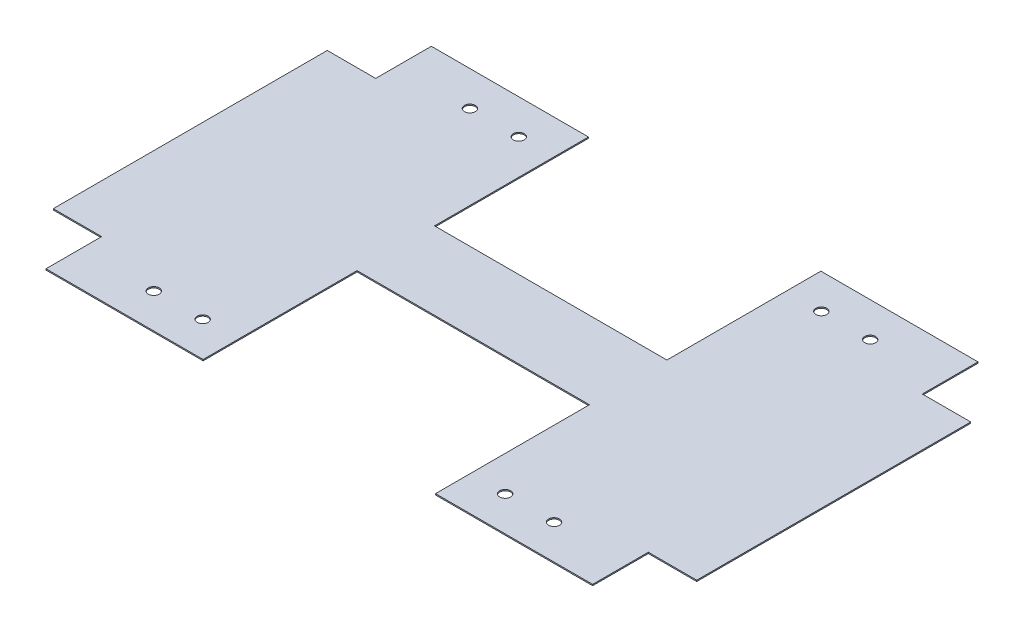
ISO-10303-21;
HEADER;
FILE_DESCRIPTION(('STEP AP214'),'2;1');
FILE_NAME('part.step','',(''),(''),'','','');
FILE_SCHEMA(('AUTOMOTIVE_DESIGN { 1 0 10303 214 1 1 1 1 }'));
ENDSEC;
DATA;
#1=APPLICATION_CONTEXT('core data for automotive mechanical design processes');
#2=APPLICATION_PROTOCOL_DEFINITION('international standard','automotive_design',2000,#1);
#3=PRODUCT_CONTEXT('',#1,'mechanical');
#4=PRODUCT('Part','Part','',(#3));
#5=PRODUCT_RELATED_PRODUCT_CATEGORY('part','',(#4));
#6=PRODUCT_DEFINITION_FORMATION('','',#4);
#7=PRODUCT_DEFINITION_CONTEXT('part definition',#1,'design');
#8=PRODUCT_DEFINITION('design','',#6,#7);
#9=PRODUCT_DEFINITION_SHAPE('','',#8);
#10=(LENGTH_UNIT() NAMED_UNIT(*) SI_UNIT(.MILLI.,.METRE.));
#11=(NAMED_UNIT(*) PLANE_ANGLE_UNIT() SI_UNIT($,.RADIAN.));
#12=(NAMED_UNIT(*) SI_UNIT($,.STERADIAN.) SOLID_ANGLE_UNIT());
#13=UNCERTAINTY_MEASURE_WITH_UNIT(LENGTH_MEASURE(1.E-05),#10,'distance_accuracy_value','');
#14=(GEOMETRIC_REPRESENTATION_CONTEXT(3) GLOBAL_UNCERTAINTY_ASSIGNED_CONTEXT((#13)) GLOBAL_UNIT_ASSIGNED_CONTEXT((#10,
#11,#12)) REPRESENTATION_CONTEXT('',''));
#15=CARTESIAN_POINT('',(0.,0.,0.));
#16=DIRECTION('',(0.,0.,1.));
#17=DIRECTION('',(1.,0.,0.));
#18=AXIS2_PLACEMENT_3D('',#15,#16,#17);
#19=CARTESIAN_POINT('',(-24.,0.25,-39.8));
#20=DIRECTION('',(0.,-1.,0.));
#21=DIRECTION('',(0.,0.,-1.));
#22=AXIS2_PLACEMENT_3D('',#19,#20,#21);
#23=PLANE('',#22);
#24=CARTESIAN_POINT('',(-31.24,0.25,32.65));
#25=DIRECTION('',(0.,1.,0.));
#26=DIRECTION('',(0.,0.,1.));
#27=AXIS2_PLACEMENT_3D('',#24,#25,#26);
#28=CIRCLE('',#27,1.125);
#29=CARTESIAN_POINT('',(-31.24,0.25,33.775));
#30=VERTEX_POINT('',#29);
#31=EDGE_CURVE('E412',#30,#30,#28,.T.);
#32=ORIENTED_EDGE('',*,*,#31,.F.);
#33=EDGE_LOOP('',(#32));
#34=FACE_BOUND('',#33,.T.);
#35=CARTESIAN_POINT('',(41.34,0.25,32.65));
#36=DIRECTION('',(0.,1.,0.));
#37=DIRECTION('',(0.,0.,1.));
#38=AXIS2_PLACEMENT_3D('',#35,#36,#37);
#39=CIRCLE('',#38,1.125);
#40=CARTESIAN_POINT('',(41.34,0.25,33.775));
#41=VERTEX_POINT('',#40);
#42=EDGE_CURVE('E424',#41,#41,#39,.T.);
#43=ORIENTED_EDGE('',*,*,#42,.F.);
#44=EDGE_LOOP('',(#43));
#45=FACE_BOUND('',#44,.T.);
#46=CARTESIAN_POINT('',(31.24,0.25,-32.65));
#47=DIRECTION('',(0.,1.,0.));
#48=DIRECTION('',(0.,0.,1.));
#49=AXIS2_PLACEMENT_3D('',#46,#47,#48);
#50=CIRCLE('',#49,1.12499999999999);
#51=CARTESIAN_POINT('',(31.24,0.25,-31.525));
#52=VERTEX_POINT('',#51);
#53=EDGE_CURVE('E436',#52,#52,#50,.T.);
#54=ORIENTED_EDGE('',*,*,#53,.F.);
#55=EDGE_LOOP('',(#54));
#56=FACE_BOUND('',#55,.T.);
#57=CARTESIAN_POINT('',(-41.34,0.25,-32.65));
#58=DIRECTION('',(0.,1.,0.));
#59=DIRECTION('',(0.,0.,1.));
#60=AXIS2_PLACEMENT_3D('',#57,#58,#59);
#61=CIRCLE('',#60,1.125);
#62=CARTESIAN_POINT('',(-41.34,0.25,-31.525));
#63=VERTEX_POINT('',#62);
#64=EDGE_CURVE('E206',#63,#63,#61,.T.);
#65=ORIENTED_EDGE('',*,*,#64,.F.);
#66=EDGE_LOOP('',(#65));
#67=FACE_BOUND('',#66,.T.);
#68=DIRECTION('',(-1.,0.,0.));
#69=VECTOR('',#68,1.);
#70=CARTESIAN_POINT('',(-56.46,0.25,-39.8));
#71=LINE('',#70,#69);
#72=CARTESIAN_POINT('',(-24.,0.25,-39.8));
#73=VERTEX_POINT('',#72);
#74=CARTESIAN_POINT('',(-56.46,0.25,-39.8));
#75=VERTEX_POINT('',#74);
#76=EDGE_CURVE('E241',#73,#75,#71,.T.);
#77=ORIENTED_EDGE('',*,*,#76,.T.);
#78=DIRECTION('',(0.,0.,1.));
#79=VECTOR('',#78,1.);
#80=CARTESIAN_POINT('',(-56.46,0.25,-39.8));
#81=LINE('',#80,#79);
#82=CARTESIAN_POINT('',(-56.46,0.25,-28.3));
#83=VERTEX_POINT('',#82);
#84=EDGE_CURVE('E129',#75,#83,#81,.T.);
#85=ORIENTED_EDGE('',*,*,#84,.T.);
#86=DIRECTION('',(-1.,0.,0.));
#87=VECTOR('',#86,1.);
#88=CARTESIAN_POINT('',(-56.46,0.25,-28.3));
#89=LINE('',#88,#87);
#90=CARTESIAN_POINT('',(-66.46,0.25,-28.3));
#91=VERTEX_POINT('',#90);
#92=EDGE_CURVE('E292',#83,#91,#89,.T.);
#93=ORIENTED_EDGE('',*,*,#92,.T.);
#94=DIRECTION('',(0.,0.,1.));
#95=VECTOR('',#94,1.);
#96=CARTESIAN_POINT('',(-66.46,0.25,-28.3));
#97=LINE('',#96,#95);
#98=CARTESIAN_POINT('',(-66.46,0.25,28.3));
#99=VERTEX_POINT('',#98);
#100=EDGE_CURVE('E311',#91,#99,#97,.T.);
#101=ORIENTED_EDGE('',*,*,#100,.T.);
#102=DIRECTION('',(1.,0.,0.));
#103=VECTOR('',#102,1.);
#104=CARTESIAN_POINT('',(-66.46,0.25,28.3));
#105=LINE('',#104,#103);
#106=CARTESIAN_POINT('',(-56.46,0.25,28.3));
#107=VERTEX_POINT('',#106);
#108=EDGE_CURVE('E308',#99,#107,#105,.T.);
#109=ORIENTED_EDGE('',*,*,#108,.T.);
#110=DIRECTION('',(0.,0.,1.));
#111=VECTOR('',#110,1.);
#112=CARTESIAN_POINT('',(-56.46,0.25,28.3));
#113=LINE('',#112,#111);
#114=CARTESIAN_POINT('',(-56.46,0.25,39.8));
#115=VERTEX_POINT('',#114);
#116=EDGE_CURVE('E310',#107,#115,#113,.T.);
#117=ORIENTED_EDGE('',*,*,#116,.T.);
#118=DIRECTION('',(1.,0.,0.));
#119=VECTOR('',#118,1.);
#120=CARTESIAN_POINT('',(-56.46,0.25,39.8));
#121=LINE('',#120,#119);
#122=CARTESIAN_POINT('',(-24.,0.25,39.8));
#123=VERTEX_POINT('',#122);
#124=EDGE_CURVE('E313',#115,#123,#121,.T.);
#125=ORIENTED_EDGE('',*,*,#124,.T.);
#126=DIRECTION('',(0.,0.,-1.));
#127=VECTOR('',#126,1.);
#128=CARTESIAN_POINT('',(-24.,0.25,39.8));
#129=LINE('',#128,#127);
#130=CARTESIAN_POINT('',(-24.,0.25,8.00000000000001));
#131=VERTEX_POINT('',#130);
#132=EDGE_CURVE('E319',#123,#131,#129,.T.);
#133=ORIENTED_EDGE('',*,*,#132,.T.);
#134=DIRECTION('',(1.,0.,0.));
#135=VECTOR('',#134,1.);
#136=CARTESIAN_POINT('',(-24.,0.25,8.00000000000001));
#137=LINE('',#136,#135);
#138=CARTESIAN_POINT('',(24.,0.25,8.00000000000001));
#139=VERTEX_POINT('',#138);
#140=EDGE_CURVE('E321',#131,#139,#137,.T.);
#141=ORIENTED_EDGE('',*,*,#140,.T.);
#142=DIRECTION('',(0.,0.,1.));
#143=VECTOR('',#142,1.);
#144=CARTESIAN_POINT('',(24.,0.25,8.00000000000001));
#145=LINE('',#144,#143);
#146=CARTESIAN_POINT('',(24.,0.25,39.8));
#147=VERTEX_POINT('',#146);
#148=EDGE_CURVE('E323',#139,#147,#145,.T.);
#149=ORIENTED_EDGE('',*,*,#148,.T.);
#150=DIRECTION('',(1.,0.,0.));
#151=VECTOR('',#150,1.);
#152=CARTESIAN_POINT('',(24.,0.25,39.8));
#153=LINE('',#152,#151);
#154=CARTESIAN_POINT('',(56.46,0.25,39.8));
#155=VERTEX_POINT('',#154);
#156=EDGE_CURVE('E325',#147,#155,#153,.T.);
#157=ORIENTED_EDGE('',*,*,#156,.T.);
#158=DIRECTION('',(0.,0.,-1.));
#159=VECTOR('',#158,1.);
#160=CARTESIAN_POINT('',(56.46,0.25,28.3));
#161=LINE('',#160,#159);
#162=CARTESIAN_POINT('',(56.46,0.25,28.3));
#163=VERTEX_POINT('',#162);
#164=EDGE_CURVE('E327',#155,#163,#161,.T.);
#165=ORIENTED_EDGE('',*,*,#164,.T.);
#166=DIRECTION('',(1.,0.,0.));
#167=VECTOR('',#166,1.);
#168=CARTESIAN_POINT('',(66.46,0.25,28.3));
#169=LINE('',#168,#167);
#170=CARTESIAN_POINT('',(66.46,0.25,28.3));
#171=VERTEX_POINT('',#170);
#172=EDGE_CURVE('E329',#163,#171,#169,.T.);
#173=ORIENTED_EDGE('',*,*,#172,.T.);
#174=DIRECTION('',(0.,0.,-1.));
#175=VECTOR('',#174,1.);
#176=CARTESIAN_POINT('',(66.46,0.25,-28.3));
#177=LINE('',#176,#175);
#178=CARTESIAN_POINT('',(66.46,0.25,-28.3));
#179=VERTEX_POINT('',#178);
#180=EDGE_CURVE('E331',#171,#179,#177,.T.);
#181=ORIENTED_EDGE('',*,*,#180,.T.);
#182=DIRECTION('',(-1.,0.,0.));
#183=VECTOR('',#182,1.);
#184=CARTESIAN_POINT('',(66.46,0.25,-28.3));
#185=LINE('',#184,#183);
#186=CARTESIAN_POINT('',(56.46,0.25,-28.3));
#187=VERTEX_POINT('',#186);
#188=EDGE_CURVE('E333',#179,#187,#185,.T.);
#189=ORIENTED_EDGE('',*,*,#188,.T.);
#190=DIRECTION('',(0.,0.,-1.));
#191=VECTOR('',#190,1.);
#192=CARTESIAN_POINT('',(56.46,0.25,-28.3));
#193=LINE('',#192,#191);
#194=CARTESIAN_POINT('',(56.46,0.25,-39.8));
#195=VERTEX_POINT('',#194);
#196=EDGE_CURVE('E335',#187,#195,#193,.T.);
#197=ORIENTED_EDGE('',*,*,#196,.T.);
#198=DIRECTION('',(-1.,0.,0.));
#199=VECTOR('',#198,1.);
#200=CARTESIAN_POINT('',(24.,0.25,-39.8));
#201=LINE('',#200,#199);
#202=CARTESIAN_POINT('',(24.,0.25,-39.8));
#203=VERTEX_POINT('',#202);
#204=EDGE_CURVE('E184',#195,#203,#201,.T.);
#205=ORIENTED_EDGE('',*,*,#204,.T.);
#206=DIRECTION('',(0.,0.,1.));
#207=VECTOR('',#206,1.);
#208=CARTESIAN_POINT('',(24.,0.25,-8.));
#209=LINE('',#208,#207);
#210=CARTESIAN_POINT('',(24.,0.25,-8.));
#211=VERTEX_POINT('',#210);
#212=EDGE_CURVE('E178',#203,#211,#209,.T.);
#213=ORIENTED_EDGE('',*,*,#212,.T.);
#214=DIRECTION('',(-1.,0.,0.));
#215=VECTOR('',#214,1.);
#216=CARTESIAN_POINT('',(-24.,0.25,-7.99999999999999));
#217=LINE('',#216,#215);
#218=CARTESIAN_POINT('',(-24.,0.25,-7.99999999999999));
#219=VERTEX_POINT('',#218);
#220=EDGE_CURVE('E182',#211,#219,#217,.T.);
#221=ORIENTED_EDGE('',*,*,#220,.T.);
#222=DIRECTION('',(0.,0.,-1.));
#223=VECTOR('',#222,1.);
#224=CARTESIAN_POINT('',(-24.,0.25,-39.8));
#225=LINE('',#224,#223);
#226=EDGE_CURVE('E50',#219,#73,#225,.T.);
#227=ORIENTED_EDGE('',*,*,#226,.T.);
#228=EDGE_LOOP('',(#77,#85,#93,#101,#109,#117,#125,#133,#141,#149,#157,#165,#173,#181,#189,#197,
#205,#213,#221,#227));
#229=FACE_BOUND('',#228,.T.);
#230=CARTESIAN_POINT('',(-31.24,0.25,-32.65));
#231=DIRECTION('',(0.,1.,0.));
#232=DIRECTION('',(0.,0.,1.));
#233=AXIS2_PLACEMENT_3D('',#230,#231,#232);
#234=CIRCLE('',#233,1.125);
#235=CARTESIAN_POINT('',(-31.24,0.25,-31.525));
#236=VERTEX_POINT('',#235);
#237=EDGE_CURVE('E442',#236,#236,#234,.T.);
#238=ORIENTED_EDGE('',*,*,#237,.F.);
#239=EDGE_LOOP('',(#238));
#240=FACE_BOUND('',#239,.T.);
#241=CARTESIAN_POINT('',(41.34,0.25,-32.65));
#242=DIRECTION('',(0.,1.,0.));
#243=DIRECTION('',(0.,0.,1.));
#244=AXIS2_PLACEMENT_3D('',#241,#242,#243);
#245=CIRCLE('',#244,1.125);
#246=CARTESIAN_POINT('',(41.34,0.25,-31.525));
#247=VERTEX_POINT('',#246);
#248=EDGE_CURVE('E430',#247,#247,#245,.T.);
#249=ORIENTED_EDGE('',*,*,#248,.F.);
#250=EDGE_LOOP('',(#249));
#251=FACE_BOUND('',#250,.T.);
#252=CARTESIAN_POINT('',(31.24,0.25,32.65));
#253=DIRECTION('',(0.,1.,0.));
#254=DIRECTION('',(0.,0.,1.));
#255=AXIS2_PLACEMENT_3D('',#252,#253,#254);
#256=CIRCLE('',#255,1.12499999999999);
#257=CARTESIAN_POINT('',(31.24,0.25,33.775));
#258=VERTEX_POINT('',#257);
#259=EDGE_CURVE('E418',#258,#258,#256,.T.);
#260=ORIENTED_EDGE('',*,*,#259,.F.);
#261=EDGE_LOOP('',(#260));
#262=FACE_BOUND('',#261,.T.);
#263=CARTESIAN_POINT('',(-41.34,0.25,32.65));
#264=DIRECTION('',(0.,1.,0.));
#265=DIRECTION('',(0.,0.,1.));
#266=AXIS2_PLACEMENT_3D('',#263,#264,#265);
#267=CIRCLE('',#266,1.125);
#268=CARTESIAN_POINT('',(-41.34,0.25,33.775));
#269=VERTEX_POINT('',#268);
#270=EDGE_CURVE('E403',#269,#269,#267,.T.);
#271=ORIENTED_EDGE('',*,*,#270,.F.);
#272=EDGE_LOOP('',(#271));
#273=FACE_BOUND('',#272,.T.);
#274=ADVANCED_FACE('F33',(#34,#45,#56,#67,#229,#240,#251,#262,#273),#23,.F.);
#275=CARTESIAN_POINT('',(-24.,0.,-39.8));
#276=DIRECTION('',(0.,-1.,0.));
#277=DIRECTION('',(0.,0.,-1.));
#278=AXIS2_PLACEMENT_3D('',#275,#276,#277);
#279=PLANE('',#278);
#280=CARTESIAN_POINT('',(-31.24,0.,32.65));
#281=DIRECTION('',(0.,1.,0.));
#282=DIRECTION('',(0.,0.,1.));
#283=AXIS2_PLACEMENT_3D('',#280,#281,#282);
#284=CIRCLE('',#283,1.125);
#285=CARTESIAN_POINT('',(-31.24,0.,33.775));
#286=VERTEX_POINT('',#285);
#287=EDGE_CURVE('E409',#286,#286,#284,.T.);
#288=ORIENTED_EDGE('',*,*,#287,.T.);
#289=EDGE_LOOP('',(#288));
#290=FACE_BOUND('',#289,.T.);
#291=CARTESIAN_POINT('',(41.34,0.,32.65));
#292=DIRECTION('',(0.,1.,0.));
#293=DIRECTION('',(0.,0.,1.));
#294=AXIS2_PLACEMENT_3D('',#291,#292,#293);
#295=CIRCLE('',#294,1.125);
#296=CARTESIAN_POINT('',(41.34,0.,33.775));
#297=VERTEX_POINT('',#296);
#298=EDGE_CURVE('E421',#297,#297,#295,.T.);
#299=ORIENTED_EDGE('',*,*,#298,.T.);
#300=EDGE_LOOP('',(#299));
#301=FACE_BOUND('',#300,.T.);
#302=CARTESIAN_POINT('',(31.24,0.,-32.65));
#303=DIRECTION('',(0.,1.,0.));
#304=DIRECTION('',(0.,0.,1.));
#305=AXIS2_PLACEMENT_3D('',#302,#303,#304);
#306=CIRCLE('',#305,1.12499999999999);
#307=CARTESIAN_POINT('',(31.24,0.,-31.525));
#308=VERTEX_POINT('',#307);
#309=EDGE_CURVE('E433',#308,#308,#306,.T.);
#310=ORIENTED_EDGE('',*,*,#309,.T.);
#311=EDGE_LOOP('',(#310));
#312=FACE_BOUND('',#311,.T.);
#313=CARTESIAN_POINT('',(-41.34,0.,-32.65));
#314=DIRECTION('',(0.,1.,0.));
#315=DIRECTION('',(0.,0.,1.));
#316=AXIS2_PLACEMENT_3D('',#313,#314,#315);
#317=CIRCLE('',#316,1.125);
#318=CARTESIAN_POINT('',(-41.34,0.,-31.525));
#319=VERTEX_POINT('',#318);
#320=EDGE_CURVE('E445',#319,#319,#317,.T.);
#321=ORIENTED_EDGE('',*,*,#320,.T.);
#322=EDGE_LOOP('',(#321));
#323=FACE_BOUND('',#322,.T.);
#324=DIRECTION('',(-1.,0.,0.));
#325=VECTOR('',#324,1.);
#326=CARTESIAN_POINT('',(-56.46,0.,-39.8));
#327=LINE('',#326,#325);
#328=CARTESIAN_POINT('',(-24.,0.,-39.8));
#329=VERTEX_POINT('',#328);
#330=CARTESIAN_POINT('',(-56.46,0.,-39.8));
#331=VERTEX_POINT('',#330);
#332=EDGE_CURVE('E202',#329,#331,#327,.T.);
#333=ORIENTED_EDGE('',*,*,#332,.F.);
#334=DIRECTION('',(0.,0.,-1.));
#335=VECTOR('',#334,1.);
#336=CARTESIAN_POINT('',(-24.,0.,-39.8));
#337=LINE('',#336,#335);
#338=CARTESIAN_POINT('',(-24.,0.,-7.99999999999999));
#339=VERTEX_POINT('',#338);
#340=EDGE_CURVE('E121',#339,#329,#337,.T.);
#341=ORIENTED_EDGE('',*,*,#340,.F.);
#342=DIRECTION('',(-1.,0.,0.));
#343=VECTOR('',#342,1.);
#344=CARTESIAN_POINT('',(-24.,0.,-7.99999999999999));
#345=LINE('',#344,#343);
#346=CARTESIAN_POINT('',(24.,0.,-8.));
#347=VERTEX_POINT('',#346);
#348=EDGE_CURVE('E115',#347,#339,#345,.T.);
#349=ORIENTED_EDGE('',*,*,#348,.F.);
#350=DIRECTION('',(0.,0.,1.));
#351=VECTOR('',#350,1.);
#352=CARTESIAN_POINT('',(24.,0.,-8.));
#353=LINE('',#352,#351);
#354=CARTESIAN_POINT('',(24.,0.,-39.8));
#355=VERTEX_POINT('',#354);
#356=EDGE_CURVE('E192',#355,#347,#353,.T.);
#357=ORIENTED_EDGE('',*,*,#356,.F.);
#358=DIRECTION('',(-1.,0.,0.));
#359=VECTOR('',#358,1.);
#360=CARTESIAN_POINT('',(24.,0.,-39.8));
#361=LINE('',#360,#359);
#362=CARTESIAN_POINT('',(56.46,0.,-39.8));
#363=VERTEX_POINT('',#362);
#364=EDGE_CURVE('E236',#363,#355,#361,.T.);
#365=ORIENTED_EDGE('',*,*,#364,.F.);
#366=DIRECTION('',(0.,0.,-1.));
#367=VECTOR('',#366,1.);
#368=CARTESIAN_POINT('',(56.46,0.,-28.3));
#369=LINE('',#368,#367);
#370=CARTESIAN_POINT('',(56.46,0.,-28.3));
#371=VERTEX_POINT('',#370);
#372=EDGE_CURVE('E234',#371,#363,#369,.T.);
#373=ORIENTED_EDGE('',*,*,#372,.F.);
#374=DIRECTION('',(-1.,0.,0.));
#375=VECTOR('',#374,1.);
#376=CARTESIAN_POINT('',(66.46,0.,-28.3));
#377=LINE('',#376,#375);
#378=CARTESIAN_POINT('',(66.46,0.,-28.3));
#379=VERTEX_POINT('',#378);
#380=EDGE_CURVE('E232',#379,#371,#377,.T.);
#381=ORIENTED_EDGE('',*,*,#380,.F.);
#382=DIRECTION('',(0.,0.,-1.));
#383=VECTOR('',#382,1.);
#384=CARTESIAN_POINT('',(66.46,0.,-28.3));
#385=LINE('',#384,#383);
#386=CARTESIAN_POINT('',(66.46,0.,28.3));
#387=VERTEX_POINT('',#386);
#388=EDGE_CURVE('E230',#387,#379,#385,.T.);
#389=ORIENTED_EDGE('',*,*,#388,.F.);
#390=DIRECTION('',(1.,0.,0.));
#391=VECTOR('',#390,1.);
#392=CARTESIAN_POINT('',(66.46,0.,28.3));
#393=LINE('',#392,#391);
#394=CARTESIAN_POINT('',(56.46,0.,28.3));
#395=VERTEX_POINT('',#394);
#396=EDGE_CURVE('E228',#395,#387,#393,.T.);
#397=ORIENTED_EDGE('',*,*,#396,.F.);
#398=DIRECTION('',(0.,0.,-1.));
#399=VECTOR('',#398,1.);
#400=CARTESIAN_POINT('',(56.46,0.,28.3));
#401=LINE('',#400,#399);
#402=CARTESIAN_POINT('',(56.46,0.,39.8));
#403=VERTEX_POINT('',#402);
#404=EDGE_CURVE('E226',#403,#395,#401,.T.);
#405=ORIENTED_EDGE('',*,*,#404,.F.);
#406=DIRECTION('',(1.,0.,0.));
#407=VECTOR('',#406,1.);
#408=CARTESIAN_POINT('',(24.,0.,39.8));
#409=LINE('',#408,#407);
#410=CARTESIAN_POINT('',(24.,0.,39.8));
#411=VERTEX_POINT('',#410);
#412=EDGE_CURVE('E224',#411,#403,#409,.T.);
#413=ORIENTED_EDGE('',*,*,#412,.F.);
#414=DIRECTION('',(0.,0.,1.));
#415=VECTOR('',#414,1.);
#416=CARTESIAN_POINT('',(24.,0.,8.00000000000001));
#417=LINE('',#416,#415);
#418=CARTESIAN_POINT('',(24.,0.,8.00000000000001));
#419=VERTEX_POINT('',#418);
#420=EDGE_CURVE('E222',#419,#411,#417,.T.);
#421=ORIENTED_EDGE('',*,*,#420,.F.);
#422=DIRECTION('',(1.,0.,0.));
#423=VECTOR('',#422,1.);
#424=CARTESIAN_POINT('',(-24.,0.,8.00000000000001));
#425=LINE('',#424,#423);
#426=CARTESIAN_POINT('',(-24.,0.,8.00000000000001));
#427=VERTEX_POINT('',#426);
#428=EDGE_CURVE('E220',#427,#419,#425,.T.);
#429=ORIENTED_EDGE('',*,*,#428,.F.);
#430=DIRECTION('',(0.,0.,-1.));
#431=VECTOR('',#430,1.);
#432=CARTESIAN_POINT('',(-24.,0.,39.8));
#433=LINE('',#432,#431);
#434=CARTESIAN_POINT('',(-24.,0.,39.8));
#435=VERTEX_POINT('',#434);
#436=EDGE_CURVE('E218',#435,#427,#433,.T.);
#437=ORIENTED_EDGE('',*,*,#436,.F.);
#438=DIRECTION('',(1.,0.,0.));
#439=VECTOR('',#438,1.);
#440=CARTESIAN_POINT('',(-56.46,0.,39.8));
#441=LINE('',#440,#439);
#442=CARTESIAN_POINT('',(-56.46,0.,39.8));
#443=VERTEX_POINT('',#442);
#444=EDGE_CURVE('E216',#443,#435,#441,.T.);
#445=ORIENTED_EDGE('',*,*,#444,.F.);
#446=DIRECTION('',(0.,0.,1.));
#447=VECTOR('',#446,1.);
#448=CARTESIAN_POINT('',(-56.46,0.,28.3));
#449=LINE('',#448,#447);
#450=CARTESIAN_POINT('',(-56.46,0.,28.3));
#451=VERTEX_POINT('',#450);
#452=EDGE_CURVE('E214',#451,#443,#449,.T.);
#453=ORIENTED_EDGE('',*,*,#452,.F.);
#454=DIRECTION('',(1.,0.,0.));
#455=VECTOR('',#454,1.);
#456=CARTESIAN_POINT('',(-66.46,0.,28.3));
#457=LINE('',#456,#455);
#458=CARTESIAN_POINT('',(-66.46,0.,28.3));
#459=VERTEX_POINT('',#458);
#460=EDGE_CURVE('E212',#459,#451,#457,.T.);
#461=ORIENTED_EDGE('',*,*,#460,.F.);
#462=DIRECTION('',(0.,0.,1.));
#463=VECTOR('',#462,1.);
#464=CARTESIAN_POINT('',(-66.46,0.,-28.3));
#465=LINE('',#464,#463);
#466=CARTESIAN_POINT('',(-66.46,0.,-28.3));
#467=VERTEX_POINT('',#466);
#468=EDGE_CURVE('E210',#467,#459,#465,.T.);
#469=ORIENTED_EDGE('',*,*,#468,.F.);
#470=DIRECTION('',(-1.,0.,0.));
#471=VECTOR('',#470,1.);
#472=CARTESIAN_POINT('',(-56.46,0.,-28.3));
#473=LINE('',#472,#471);
#474=CARTESIAN_POINT('',(-56.46,0.,-28.3));
#475=VERTEX_POINT('',#474);
#476=EDGE_CURVE('E208',#475,#467,#473,.T.);
#477=ORIENTED_EDGE('',*,*,#476,.F.);
#478=DIRECTION('',(0.,0.,1.));
#479=VECTOR('',#478,1.);
#480=CARTESIAN_POINT('',(-56.46,0.,-39.8));
#481=LINE('',#480,#479);
#482=EDGE_CURVE('E205',#331,#475,#481,.T.);
#483=ORIENTED_EDGE('',*,*,#482,.F.);
#484=EDGE_LOOP('',(#333,#341,#349,#357,#365,#373,#381,#389,#397,#405,#413,#421,#429,#437,#445,
#453,#461,#469,#477,#483));
#485=FACE_BOUND('',#484,.T.);
#486=CARTESIAN_POINT('',(-31.24,0.,-32.65));
#487=DIRECTION('',(0.,1.,0.));
#488=DIRECTION('',(0.,0.,1.));
#489=AXIS2_PLACEMENT_3D('',#486,#487,#488);
#490=CIRCLE('',#489,1.125);
#491=CARTESIAN_POINT('',(-31.24,0.,-31.525));
#492=VERTEX_POINT('',#491);
#493=EDGE_CURVE('E439',#492,#492,#490,.T.);
#494=ORIENTED_EDGE('',*,*,#493,.T.);
#495=EDGE_LOOP('',(#494));
#496=FACE_BOUND('',#495,.T.);
#497=CARTESIAN_POINT('',(41.34,0.,-32.65));
#498=DIRECTION('',(0.,1.,0.));
#499=DIRECTION('',(0.,0.,1.));
#500=AXIS2_PLACEMENT_3D('',#497,#498,#499);
#501=CIRCLE('',#500,1.125);
#502=CARTESIAN_POINT('',(41.34,0.,-31.525));
#503=VERTEX_POINT('',#502);
#504=EDGE_CURVE('E427',#503,#503,#501,.T.);
#505=ORIENTED_EDGE('',*,*,#504,.T.);
#506=EDGE_LOOP('',(#505));
#507=FACE_BOUND('',#506,.T.);
#508=CARTESIAN_POINT('',(31.24,0.,32.65));
#509=DIRECTION('',(0.,1.,0.));
#510=DIRECTION('',(0.,0.,1.));
#511=AXIS2_PLACEMENT_3D('',#508,#509,#510);
#512=CIRCLE('',#511,1.12499999999999);
#513=CARTESIAN_POINT('',(31.24,0.,33.775));
#514=VERTEX_POINT('',#513);
#515=EDGE_CURVE('E415',#514,#514,#512,.T.);
#516=ORIENTED_EDGE('',*,*,#515,.T.);
#517=EDGE_LOOP('',(#516));
#518=FACE_BOUND('',#517,.T.);
#519=CARTESIAN_POINT('',(-41.34,0.,32.65));
#520=DIRECTION('',(0.,1.,0.));
#521=DIRECTION('',(0.,0.,1.));
#522=AXIS2_PLACEMENT_3D('',#519,#520,#521);
#523=CIRCLE('',#522,1.125);
#524=CARTESIAN_POINT('',(-41.34,0.,33.775));
#525=VERTEX_POINT('',#524);
#526=EDGE_CURVE('E406',#525,#525,#523,.T.);
#527=ORIENTED_EDGE('',*,*,#526,.T.);
#528=EDGE_LOOP('',(#527));
#529=FACE_BOUND('',#528,.T.);
#530=ADVANCED_FACE('F296',(#290,#301,#312,#323,#485,#496,#507,#518,#529),#279,.T.);
#531=CARTESIAN_POINT('',(-56.46,0.25,-39.8));
#532=DIRECTION('',(0.,0.,1.));
#533=DIRECTION('',(1.,0.,0.));
#534=AXIS2_PLACEMENT_3D('',#531,#532,#533);
#535=PLANE('',#534);
#536=ORIENTED_EDGE('',*,*,#332,.T.);
#537=DIRECTION('',(0.,-1.,0.));
#538=VECTOR('',#537,1.);
#539=CARTESIAN_POINT('',(-56.46,0.25,-39.8));
#540=LINE('',#539,#538);
#541=EDGE_CURVE('E11',#75,#331,#540,.T.);
#542=ORIENTED_EDGE('',*,*,#541,.F.);
#543=ORIENTED_EDGE('',*,*,#76,.F.);
#544=DIRECTION('',(0.,-1.,0.));
#545=VECTOR('',#544,1.);
#546=CARTESIAN_POINT('',(-24.,0.25,-39.8));
#547=LINE('',#546,#545);
#548=EDGE_CURVE('E198',#73,#329,#547,.T.);
#549=ORIENTED_EDGE('',*,*,#548,.T.);
#550=EDGE_LOOP('',(#536,#542,#543,#549));
#551=FACE_BOUND('',#550,.T.);
#552=ADVANCED_FACE('F35',(#551),#535,.F.);
#553=CARTESIAN_POINT('',(-56.46,0.25,-39.8));
#554=DIRECTION('',(1.,0.,0.));
#555=DIRECTION('',(0.,0.,-1.));
#556=AXIS2_PLACEMENT_3D('',#553,#554,#555);
#557=PLANE('',#556);
#558=ORIENTED_EDGE('',*,*,#482,.T.);
#559=DIRECTION('',(0.,-1.,0.));
#560=VECTOR('',#559,1.);
#561=CARTESIAN_POINT('',(-56.46,0.25,-28.3));
#562=LINE('',#561,#560);
#563=EDGE_CURVE('E42',#83,#475,#562,.T.);
#564=ORIENTED_EDGE('',*,*,#563,.F.);
#565=ORIENTED_EDGE('',*,*,#84,.F.);
#566=ORIENTED_EDGE('',*,*,#541,.T.);
#567=EDGE_LOOP('',(#558,#564,#565,#566));
#568=FACE_BOUND('',#567,.T.);
#569=ADVANCED_FACE('F670',(#568),#557,.F.);
#570=CARTESIAN_POINT('',(-56.46,0.25,-28.3));
#571=DIRECTION('',(0.,0.,1.));
#572=DIRECTION('',(1.,0.,0.));
#573=AXIS2_PLACEMENT_3D('',#570,#571,#572);
#574=PLANE('',#573);
#575=ORIENTED_EDGE('',*,*,#476,.T.);
#576=DIRECTION('',(0.,-1.,0.));
#577=VECTOR('',#576,1.);
#578=CARTESIAN_POINT('',(-66.46,0.25,-28.3));
#579=LINE('',#578,#577);
#580=EDGE_CURVE('E284',#91,#467,#579,.T.);
#581=ORIENTED_EDGE('',*,*,#580,.F.);
#582=ORIENTED_EDGE('',*,*,#92,.F.);
#583=ORIENTED_EDGE('',*,*,#563,.T.);
#584=EDGE_LOOP('',(#575,#581,#582,#583));
#585=FACE_BOUND('',#584,.T.);
#586=ADVANCED_FACE('F290',(#585),#574,.F.);
#587=CARTESIAN_POINT('',(-66.46,0.25,-28.3));
#588=DIRECTION('',(1.,0.,0.));
#589=DIRECTION('',(0.,0.,-1.));
#590=AXIS2_PLACEMENT_3D('',#587,#588,#589);
#591=PLANE('',#590);
#592=ORIENTED_EDGE('',*,*,#468,.T.);
#593=DIRECTION('',(0.,-1.,0.));
#594=VECTOR('',#593,1.);
#595=CARTESIAN_POINT('',(-66.46,0.25,28.3));
#596=LINE('',#595,#594);
#597=EDGE_CURVE('E281',#99,#459,#596,.T.);
#598=ORIENTED_EDGE('',*,*,#597,.F.);
#599=ORIENTED_EDGE('',*,*,#100,.F.);
#600=ORIENTED_EDGE('',*,*,#580,.T.);
#601=EDGE_LOOP('',(#592,#598,#599,#600));
#602=FACE_BOUND('',#601,.T.);
#603=ADVANCED_FACE('F302',(#602),#591,.F.);
#604=CARTESIAN_POINT('',(-66.46,0.25,28.3));
#605=DIRECTION('',(0.,0.,-1.));
#606=DIRECTION('',(-1.,0.,0.));
#607=AXIS2_PLACEMENT_3D('',#604,#605,#606);
#608=PLANE('',#607);
#609=ORIENTED_EDGE('',*,*,#460,.T.);
#610=DIRECTION('',(0.,-1.,0.));
#611=VECTOR('',#610,1.);
#612=CARTESIAN_POINT('',(-56.46,0.25,28.3));
#613=LINE('',#612,#611);
#614=EDGE_CURVE('E278',#107,#451,#613,.T.);
#615=ORIENTED_EDGE('',*,*,#614,.F.);
#616=ORIENTED_EDGE('',*,*,#108,.F.);
#617=ORIENTED_EDGE('',*,*,#597,.T.);
#618=EDGE_LOOP('',(#609,#615,#616,#617));
#619=FACE_BOUND('',#618,.T.);
#620=ADVANCED_FACE('F306',(#619),#608,.F.);
#621=CARTESIAN_POINT('',(-56.46,0.25,28.3));
#622=DIRECTION('',(1.,0.,0.));
#623=DIRECTION('',(0.,0.,-1.));
#624=AXIS2_PLACEMENT_3D('',#621,#622,#623);
#625=PLANE('',#624);
#626=ORIENTED_EDGE('',*,*,#452,.T.);
#627=DIRECTION('',(0.,-1.,0.));
#628=VECTOR('',#627,1.);
#629=CARTESIAN_POINT('',(-56.46,0.25,39.8));
#630=LINE('',#629,#628);
#631=EDGE_CURVE('E275',#115,#443,#630,.T.);
#632=ORIENTED_EDGE('',*,*,#631,.F.);
#633=ORIENTED_EDGE('',*,*,#116,.F.);
#634=ORIENTED_EDGE('',*,*,#614,.T.);
#635=EDGE_LOOP('',(#626,#632,#633,#634));
#636=FACE_BOUND('',#635,.T.);
#637=ADVANCED_FACE('F635',(#636),#625,.F.);
#638=CARTESIAN_POINT('',(-56.46,0.25,39.8));
#639=DIRECTION('',(0.,0.,-1.));
#640=DIRECTION('',(-1.,0.,0.));
#641=AXIS2_PLACEMENT_3D('',#638,#639,#640);
#642=PLANE('',#641);
#643=ORIENTED_EDGE('',*,*,#444,.T.);
#644=DIRECTION('',(0.,-1.,0.));
#645=VECTOR('',#644,1.);
#646=CARTESIAN_POINT('',(-24.,0.25,39.8));
#647=LINE('',#646,#645);
#648=EDGE_CURVE('E272',#123,#435,#647,.T.);
#649=ORIENTED_EDGE('',*,*,#648,.F.);
#650=ORIENTED_EDGE('',*,*,#124,.F.);
#651=ORIENTED_EDGE('',*,*,#631,.T.);
#652=EDGE_LOOP('',(#643,#649,#650,#651));
#653=FACE_BOUND('',#652,.T.);
#654=ADVANCED_FACE('F625',(#653),#642,.F.);
#655=CARTESIAN_POINT('',(-24.,0.25,39.8));
#656=DIRECTION('',(-1.,0.,0.));
#657=DIRECTION('',(0.,0.,1.));
#658=AXIS2_PLACEMENT_3D('',#655,#656,#657);
#659=PLANE('',#658);
#660=ORIENTED_EDGE('',*,*,#436,.T.);
#661=DIRECTION('',(0.,-1.,0.));
#662=VECTOR('',#661,1.);
#663=CARTESIAN_POINT('',(-24.,0.25,8.00000000000001));
#664=LINE('',#663,#662);
#665=EDGE_CURVE('E269',#131,#427,#664,.T.);
#666=ORIENTED_EDGE('',*,*,#665,.F.);
#667=ORIENTED_EDGE('',*,*,#132,.F.);
#668=ORIENTED_EDGE('',*,*,#648,.T.);
#669=EDGE_LOOP('',(#660,#666,#667,#668));
#670=FACE_BOUND('',#669,.T.);
#671=ADVANCED_FACE('F615',(#670),#659,.F.);
#672=CARTESIAN_POINT('',(-24.,0.25,8.00000000000001));
#673=DIRECTION('',(0.,0.,-1.));
#674=DIRECTION('',(-1.,0.,0.));
#675=AXIS2_PLACEMENT_3D('',#672,#673,#674);
#676=PLANE('',#675);
#677=ORIENTED_EDGE('',*,*,#428,.T.);
#678=DIRECTION('',(0.,-1.,0.));
#679=VECTOR('',#678,1.);
#680=CARTESIAN_POINT('',(24.,0.25,8.00000000000001));
#681=LINE('',#680,#679);
#682=EDGE_CURVE('E266',#139,#419,#681,.T.);
#683=ORIENTED_EDGE('',*,*,#682,.F.);
#684=ORIENTED_EDGE('',*,*,#140,.F.);
#685=ORIENTED_EDGE('',*,*,#665,.T.);
#686=EDGE_LOOP('',(#677,#683,#684,#685));
#687=FACE_BOUND('',#686,.T.);
#688=ADVANCED_FACE('F605',(#687),#676,.F.);
#689=CARTESIAN_POINT('',(24.,0.25,8.00000000000001));
#690=DIRECTION('',(1.,0.,0.));
#691=DIRECTION('',(0.,0.,-1.));
#692=AXIS2_PLACEMENT_3D('',#689,#690,#691);
#693=PLANE('',#692);
#694=ORIENTED_EDGE('',*,*,#420,.T.);
#695=DIRECTION('',(0.,-1.,0.));
#696=VECTOR('',#695,1.);
#697=CARTESIAN_POINT('',(24.,0.25,39.8));
#698=LINE('',#697,#696);
#699=EDGE_CURVE('E263',#147,#411,#698,.T.);
#700=ORIENTED_EDGE('',*,*,#699,.F.);
#701=ORIENTED_EDGE('',*,*,#148,.F.);
#702=ORIENTED_EDGE('',*,*,#682,.T.);
#703=EDGE_LOOP('',(#694,#700,#701,#702));
#704=FACE_BOUND('',#703,.T.);
#705=ADVANCED_FACE('F595',(#704),#693,.F.);
#706=CARTESIAN_POINT('',(24.,0.25,39.8));
#707=DIRECTION('',(0.,0.,-1.));
#708=DIRECTION('',(-1.,0.,0.));
#709=AXIS2_PLACEMENT_3D('',#706,#707,#708);
#710=PLANE('',#709);
#711=ORIENTED_EDGE('',*,*,#412,.T.);
#712=DIRECTION('',(0.,-1.,0.));
#713=VECTOR('',#712,1.);
#714=CARTESIAN_POINT('',(56.46,0.25,39.8));
#715=LINE('',#714,#713);
#716=EDGE_CURVE('E260',#155,#403,#715,.T.);
#717=ORIENTED_EDGE('',*,*,#716,.F.);
#718=ORIENTED_EDGE('',*,*,#156,.F.);
#719=ORIENTED_EDGE('',*,*,#699,.T.);
#720=EDGE_LOOP('',(#711,#717,#718,#719));
#721=FACE_BOUND('',#720,.T.);
#722=ADVANCED_FACE('F585',(#721),#710,.F.);
#723=CARTESIAN_POINT('',(56.46,0.25,28.3));
#724=DIRECTION('',(-1.,0.,0.));
#725=DIRECTION('',(0.,0.,1.));
#726=AXIS2_PLACEMENT_3D('',#723,#724,#725);
#727=PLANE('',#726);
#728=ORIENTED_EDGE('',*,*,#404,.T.);
#729=DIRECTION('',(0.,-1.,0.));
#730=VECTOR('',#729,1.);
#731=CARTESIAN_POINT('',(56.46,0.25,28.3));
#732=LINE('',#731,#730);
#733=EDGE_CURVE('E257',#163,#395,#732,.T.);
#734=ORIENTED_EDGE('',*,*,#733,.F.);
#735=ORIENTED_EDGE('',*,*,#164,.F.);
#736=ORIENTED_EDGE('',*,*,#716,.T.);
#737=EDGE_LOOP('',(#728,#734,#735,#736));
#738=FACE_BOUND('',#737,.T.);
#739=ADVANCED_FACE('F575',(#738),#727,.F.);
#740=CARTESIAN_POINT('',(66.46,0.25,28.3));
#741=DIRECTION('',(0.,0.,-1.));
#742=DIRECTION('',(-1.,0.,0.));
#743=AXIS2_PLACEMENT_3D('',#740,#741,#742);
#744=PLANE('',#743);
#745=ORIENTED_EDGE('',*,*,#396,.T.);
#746=DIRECTION('',(0.,-1.,0.));
#747=VECTOR('',#746,1.);
#748=CARTESIAN_POINT('',(66.46,0.25,28.3));
#749=LINE('',#748,#747);
#750=EDGE_CURVE('E254',#171,#387,#749,.T.);
#751=ORIENTED_EDGE('',*,*,#750,.F.);
#752=ORIENTED_EDGE('',*,*,#172,.F.);
#753=ORIENTED_EDGE('',*,*,#733,.T.);
#754=EDGE_LOOP('',(#745,#751,#752,#753));
#755=FACE_BOUND('',#754,.T.);
#756=ADVANCED_FACE('F565',(#755),#744,.F.);
#757=CARTESIAN_POINT('',(66.46,0.25,-28.3));
#758=DIRECTION('',(-1.,0.,0.));
#759=DIRECTION('',(0.,0.,1.));
#760=AXIS2_PLACEMENT_3D('',#757,#758,#759);
#761=PLANE('',#760);
#762=ORIENTED_EDGE('',*,*,#388,.T.);
#763=DIRECTION('',(0.,-1.,0.));
#764=VECTOR('',#763,1.);
#765=CARTESIAN_POINT('',(66.46,0.25,-28.3));
#766=LINE('',#765,#764);
#767=EDGE_CURVE('E251',#179,#379,#766,.T.);
#768=ORIENTED_EDGE('',*,*,#767,.F.);
#769=ORIENTED_EDGE('',*,*,#180,.F.);
#770=ORIENTED_EDGE('',*,*,#750,.T.);
#771=EDGE_LOOP('',(#762,#768,#769,#770));
#772=FACE_BOUND('',#771,.T.);
#773=ADVANCED_FACE('F555',(#772),#761,.F.);
#774=CARTESIAN_POINT('',(66.46,0.25,-28.3));
#775=DIRECTION('',(0.,0.,1.));
#776=DIRECTION('',(1.,0.,0.));
#777=AXIS2_PLACEMENT_3D('',#774,#775,#776);
#778=PLANE('',#777);
#779=ORIENTED_EDGE('',*,*,#380,.T.);
#780=DIRECTION('',(0.,-1.,0.));
#781=VECTOR('',#780,1.);
#782=CARTESIAN_POINT('',(56.46,0.25,-28.3));
#783=LINE('',#782,#781);
#784=EDGE_CURVE('E248',#187,#371,#783,.T.);
#785=ORIENTED_EDGE('',*,*,#784,.F.);
#786=ORIENTED_EDGE('',*,*,#188,.F.);
#787=ORIENTED_EDGE('',*,*,#767,.T.);
#788=EDGE_LOOP('',(#779,#785,#786,#787));
#789=FACE_BOUND('',#788,.T.);
#790=ADVANCED_FACE('F546',(#789),#778,.F.);
#791=CARTESIAN_POINT('',(56.46,0.25,-28.3));
#792=DIRECTION('',(-1.,0.,0.));
#793=DIRECTION('',(0.,0.,1.));
#794=AXIS2_PLACEMENT_3D('',#791,#792,#793);
#795=PLANE('',#794);
#796=ORIENTED_EDGE('',*,*,#372,.T.);
#797=DIRECTION('',(0.,-1.,0.));
#798=VECTOR('',#797,1.);
#799=CARTESIAN_POINT('',(56.46,0.25,-39.8));
#800=LINE('',#799,#798);
#801=EDGE_CURVE('E245',#195,#363,#800,.T.);
#802=ORIENTED_EDGE('',*,*,#801,.F.);
#803=ORIENTED_EDGE('',*,*,#196,.F.);
#804=ORIENTED_EDGE('',*,*,#784,.T.);
#805=EDGE_LOOP('',(#796,#802,#803,#804));
#806=FACE_BOUND('',#805,.T.);
#807=ADVANCED_FACE('F341',(#806),#795,.F.);
#808=CARTESIAN_POINT('',(24.,0.25,-39.8));
#809=DIRECTION('',(0.,0.,1.));
#810=DIRECTION('',(1.,0.,0.));
#811=AXIS2_PLACEMENT_3D('',#808,#809,#810);
#812=PLANE('',#811);
#813=ORIENTED_EDGE('',*,*,#364,.T.);
#814=DIRECTION('',(0.,-1.,0.));
#815=VECTOR('',#814,1.);
#816=CARTESIAN_POINT('',(24.,0.25,-39.8));
#817=LINE('',#816,#815);
#818=EDGE_CURVE('E193',#203,#355,#817,.T.);
#819=ORIENTED_EDGE('',*,*,#818,.F.);
#820=ORIENTED_EDGE('',*,*,#204,.F.);
#821=ORIENTED_EDGE('',*,*,#801,.T.);
#822=EDGE_LOOP('',(#813,#819,#820,#821));
#823=FACE_BOUND('',#822,.T.);
#824=ADVANCED_FACE('F345',(#823),#812,.F.);
#825=CARTESIAN_POINT('',(24.,0.25,-8.));
#826=DIRECTION('',(1.,0.,0.));
#827=DIRECTION('',(0.,0.,-1.));
#828=AXIS2_PLACEMENT_3D('',#825,#826,#827);
#829=PLANE('',#828);
#830=ORIENTED_EDGE('',*,*,#356,.T.);
#831=DIRECTION('',(0.,-1.,0.));
#832=VECTOR('',#831,1.);
#833=CARTESIAN_POINT('',(24.,0.25,-8.));
#834=LINE('',#833,#832);
#835=EDGE_CURVE('E189',#211,#347,#834,.T.);
#836=ORIENTED_EDGE('',*,*,#835,.F.);
#837=ORIENTED_EDGE('',*,*,#212,.F.);
#838=ORIENTED_EDGE('',*,*,#818,.T.);
#839=EDGE_LOOP('',(#830,#836,#837,#838));
#840=FACE_BOUND('',#839,.T.);
#841=ADVANCED_FACE('F190',(#840),#829,.F.);
#842=CARTESIAN_POINT('',(-24.,0.25,-7.99999999999999));
#843=DIRECTION('',(0.,0.,1.));
#844=DIRECTION('',(1.,0.,0.));
#845=AXIS2_PLACEMENT_3D('',#842,#843,#844);
#846=PLANE('',#845);
#847=ORIENTED_EDGE('',*,*,#348,.T.);
#848=DIRECTION('',(0.,-1.,0.));
#849=VECTOR('',#848,1.);
#850=CARTESIAN_POINT('',(-24.,0.25,-7.99999999999999));
#851=LINE('',#850,#849);
#852=EDGE_CURVE('E194',#219,#339,#851,.T.);
#853=ORIENTED_EDGE('',*,*,#852,.F.);
#854=ORIENTED_EDGE('',*,*,#220,.F.);
#855=ORIENTED_EDGE('',*,*,#835,.T.);
#856=EDGE_LOOP('',(#847,#853,#854,#855));
#857=FACE_BOUND('',#856,.T.);
#858=ADVANCED_FACE('F196',(#857),#846,.F.);
#859=CARTESIAN_POINT('',(-24.,0.25,-39.8));
#860=DIRECTION('',(-1.,0.,0.));
#861=DIRECTION('',(0.,0.,1.));
#862=AXIS2_PLACEMENT_3D('',#859,#860,#861);
#863=PLANE('',#862);
#864=ORIENTED_EDGE('',*,*,#340,.T.);
#865=ORIENTED_EDGE('',*,*,#548,.F.);
#866=ORIENTED_EDGE('',*,*,#226,.F.);
#867=ORIENTED_EDGE('',*,*,#852,.T.);
#868=EDGE_LOOP('',(#864,#865,#866,#867));
#869=FACE_BOUND('',#868,.T.);
#870=ADVANCED_FACE('F349',(#869),#863,.F.);
#871=CARTESIAN_POINT('',(-41.34,0.25,-32.65));
#872=DIRECTION('',(0.,-1.,0.));
#873=DIRECTION('',(0.,0.,-1.));
#874=AXIS2_PLACEMENT_3D('',#871,#872,#873);
#875=CYLINDRICAL_SURFACE('',#874,1.125);
#876=ORIENTED_EDGE('',*,*,#64,.T.);
#877=EDGE_LOOP('',(#876));
#878=FACE_BOUND('',#877,.T.);
#879=ORIENTED_EDGE('',*,*,#320,.F.);
#880=EDGE_LOOP('',(#879));
#881=FACE_BOUND('',#880,.T.);
#882=ADVANCED_FACE('F351',(#878,#881),#875,.F.);
#883=CARTESIAN_POINT('',(-31.24,0.25,-32.65));
#884=DIRECTION('',(0.,-1.,0.));
#885=DIRECTION('',(0.,0.,-1.));
#886=AXIS2_PLACEMENT_3D('',#883,#884,#885);
#887=CYLINDRICAL_SURFACE('',#886,1.125);
#888=ORIENTED_EDGE('',*,*,#237,.T.);
#889=EDGE_LOOP('',(#888));
#890=FACE_BOUND('',#889,.T.);
#891=ORIENTED_EDGE('',*,*,#493,.F.);
#892=EDGE_LOOP('',(#891));
#893=FACE_BOUND('',#892,.T.);
#894=ADVANCED_FACE('F357',(#890,#893),#887,.F.);
#895=CARTESIAN_POINT('',(31.24,0.25,-32.65));
#896=DIRECTION('',(0.,-1.,0.));
#897=DIRECTION('',(0.,0.,-1.));
#898=AXIS2_PLACEMENT_3D('',#895,#896,#897);
#899=CYLINDRICAL_SURFACE('',#898,1.12499999999999);
#900=ORIENTED_EDGE('',*,*,#53,.T.);
#901=EDGE_LOOP('',(#900));
#902=FACE_BOUND('',#901,.T.);
#903=ORIENTED_EDGE('',*,*,#309,.F.);
#904=EDGE_LOOP('',(#903));
#905=FACE_BOUND('',#904,.T.);
#906=ADVANCED_FACE('F374',(#902,#905),#899,.F.);
#907=CARTESIAN_POINT('',(41.34,0.25,-32.65));
#908=DIRECTION('',(0.,-1.,0.));
#909=DIRECTION('',(0.,0.,-1.));
#910=AXIS2_PLACEMENT_3D('',#907,#908,#909);
#911=CYLINDRICAL_SURFACE('',#910,1.125);
#912=ORIENTED_EDGE('',*,*,#248,.T.);
#913=EDGE_LOOP('',(#912));
#914=FACE_BOUND('',#913,.T.);
#915=ORIENTED_EDGE('',*,*,#504,.F.);
#916=EDGE_LOOP('',(#915));
#917=FACE_BOUND('',#916,.T.);
#918=ADVANCED_FACE('F378',(#914,#917),#911,.F.);
#919=CARTESIAN_POINT('',(41.34,0.25,32.65));
#920=DIRECTION('',(0.,-1.,0.));
#921=DIRECTION('',(0.,0.,-1.));
#922=AXIS2_PLACEMENT_3D('',#919,#920,#921);
#923=CYLINDRICAL_SURFACE('',#922,1.125);
#924=ORIENTED_EDGE('',*,*,#42,.T.);
#925=EDGE_LOOP('',(#924));
#926=FACE_BOUND('',#925,.T.);
#927=ORIENTED_EDGE('',*,*,#298,.F.);
#928=EDGE_LOOP('',(#927));
#929=FACE_BOUND('',#928,.T.);
#930=ADVANCED_FACE('F382',(#926,#929),#923,.F.);
#931=CARTESIAN_POINT('',(31.24,0.25,32.65));
#932=DIRECTION('',(0.,-1.,0.));
#933=DIRECTION('',(0.,0.,-1.));
#934=AXIS2_PLACEMENT_3D('',#931,#932,#933);
#935=CYLINDRICAL_SURFACE('',#934,1.12499999999999);
#936=ORIENTED_EDGE('',*,*,#259,.T.);
#937=EDGE_LOOP('',(#936));
#938=FACE_BOUND('',#937,.T.);
#939=ORIENTED_EDGE('',*,*,#515,.F.);
#940=EDGE_LOOP('',(#939));
#941=FACE_BOUND('',#940,.T.);
#942=ADVANCED_FACE('F386',(#938,#941),#935,.F.);
#943=CARTESIAN_POINT('',(-31.24,0.25,32.65));
#944=DIRECTION('',(0.,-1.,0.));
#945=DIRECTION('',(0.,0.,-1.));
#946=AXIS2_PLACEMENT_3D('',#943,#944,#945);
#947=CYLINDRICAL_SURFACE('',#946,1.125);
#948=ORIENTED_EDGE('',*,*,#31,.T.);
#949=EDGE_LOOP('',(#948));
#950=FACE_BOUND('',#949,.T.);
#951=ORIENTED_EDGE('',*,*,#287,.F.);
#952=EDGE_LOOP('',(#951));
#953=FACE_BOUND('',#952,.T.);
#954=ADVANCED_FACE('F390',(#950,#953),#947,.F.);
#955=CARTESIAN_POINT('',(-41.34,0.25,32.65));
#956=DIRECTION('',(0.,-1.,0.));
#957=DIRECTION('',(0.,0.,-1.));
#958=AXIS2_PLACEMENT_3D('',#955,#956,#957);
#959=CYLINDRICAL_SURFACE('',#958,1.125);
#960=ORIENTED_EDGE('',*,*,#270,.T.);
#961=EDGE_LOOP('',(#960));
#962=FACE_BOUND('',#961,.T.);
#963=ORIENTED_EDGE('',*,*,#526,.F.);
#964=EDGE_LOOP('',(#963));
#965=FACE_BOUND('',#964,.T.);
#966=ADVANCED_FACE('F394',(#962,#965),#959,.F.);
#967=CLOSED_SHELL('',(#274,#530,#552,#569,#586,#603,#620,#637,#654,#671,#688,#705,#722,#739,
#756,#773,#790,#807,#824,#841,#858,#870,#882,#894,#906,#918,#930,#942,#954,#966));
#968=MANIFOLD_SOLID_BREP('B2',#967);
#969=ADVANCED_BREP_SHAPE_REPRESENTATION('',(#18,#968),#14);
#970=SHAPE_DEFINITION_REPRESENTATION(#9,#969);
ENDSEC;
END-ISO-10303-21;
